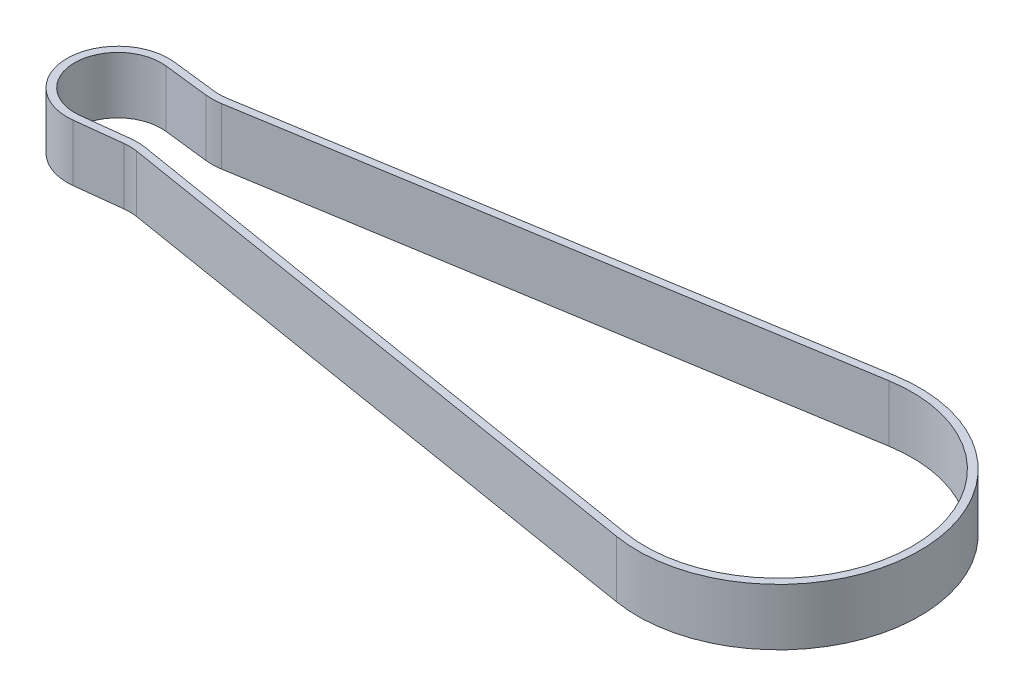
ISO-10303-21;
HEADER;
FILE_DESCRIPTION(('STEP AP214'),'2;1');
FILE_NAME('part.step','',(''),(''),'','','');
FILE_SCHEMA(('AUTOMOTIVE_DESIGN { 1 0 10303 214 1 1 1 1 }'));
ENDSEC;
DATA;
#1=APPLICATION_CONTEXT('core data for automotive mechanical design processes');
#2=APPLICATION_PROTOCOL_DEFINITION('international standard','automotive_design',2000,#1);
#3=PRODUCT_CONTEXT('',#1,'mechanical');
#4=PRODUCT('Part','Part','',(#3));
#5=PRODUCT_RELATED_PRODUCT_CATEGORY('part','',(#4));
#6=PRODUCT_DEFINITION_FORMATION('','',#4);
#7=PRODUCT_DEFINITION_CONTEXT('part definition',#1,'design');
#8=PRODUCT_DEFINITION('design','',#6,#7);
#9=PRODUCT_DEFINITION_SHAPE('','',#8);
#10=(LENGTH_UNIT() NAMED_UNIT(*) SI_UNIT(.MILLI.,.METRE.));
#11=(NAMED_UNIT(*) PLANE_ANGLE_UNIT() SI_UNIT($,.RADIAN.));
#12=(NAMED_UNIT(*) SI_UNIT($,.STERADIAN.) SOLID_ANGLE_UNIT());
#13=UNCERTAINTY_MEASURE_WITH_UNIT(LENGTH_MEASURE(1.E-05),#10,'distance_accuracy_value','');
#14=(GEOMETRIC_REPRESENTATION_CONTEXT(3) GLOBAL_UNCERTAINTY_ASSIGNED_CONTEXT((#13)) GLOBAL_UNIT_ASSIGNED_CONTEXT((#10,
#11,#12)) REPRESENTATION_CONTEXT('',''));
#15=CARTESIAN_POINT('',(0.,0.,0.));
#16=DIRECTION('',(0.,0.,1.));
#17=DIRECTION('',(1.,0.,0.));
#18=AXIS2_PLACEMENT_3D('',#15,#16,#17);
#19=CARTESIAN_POINT('',(0.,-3.,0.));
#20=DIRECTION('',(0.,1.,0.));
#21=DIRECTION('',(0.,0.,1.));
#22=AXIS2_PLACEMENT_3D('',#19,#20,#21);
#23=CYLINDRICAL_SURFACE('',#22,5.375);
#24=DIRECTION('',(0.,1.,0.));
#25=VECTOR('',#24,1.);
#26=CARTESIAN_POINT('',(0.617779055512067,-3.,5.33937955558233));
#27=LINE('',#26,#25);
#28=CARTESIAN_POINT('',(0.617779055512067,-3.,5.33937955558233));
#29=VERTEX_POINT('',#28);
#30=CARTESIAN_POINT('',(0.617779055512067,3.,5.33937955558233));
#31=VERTEX_POINT('',#30);
#32=EDGE_CURVE('E138',#29,#31,#27,.T.);
#33=ORIENTED_EDGE('',*,*,#32,.T.);
#34=CARTESIAN_POINT('',(0.,3.,0.));
#35=DIRECTION('',(0.,1.,0.));
#36=DIRECTION('',(1.,0.,0.));
#37=AXIS2_PLACEMENT_3D('',#34,#35,#36);
#38=CIRCLE('',#37,5.375);
#39=CARTESIAN_POINT('',(0.617779055512381,3.,-5.3393795555823));
#40=VERTEX_POINT('',#39);
#41=EDGE_CURVE('E291',#40,#31,#38,.T.);
#42=ORIENTED_EDGE('',*,*,#41,.F.);
#43=DIRECTION('',(0.,1.,0.));
#44=VECTOR('',#43,1.);
#45=CARTESIAN_POINT('',(0.617779055512381,-3.,-5.3393795555823));
#46=LINE('',#45,#44);
#47=CARTESIAN_POINT('',(0.617779055512381,-3.,-5.3393795555823));
#48=VERTEX_POINT('',#47);
#49=EDGE_CURVE('E12',#48,#40,#46,.T.);
#50=ORIENTED_EDGE('',*,*,#49,.F.);
#51=CARTESIAN_POINT('',(0.,-3.,0.));
#52=DIRECTION('',(0.,1.,0.));
#53=DIRECTION('',(1.,0.,0.));
#54=AXIS2_PLACEMENT_3D('',#51,#52,#53);
#55=CIRCLE('',#54,5.375);
#56=EDGE_CURVE('E334',#48,#29,#55,.T.);
#57=ORIENTED_EDGE('',*,*,#56,.T.);
#58=EDGE_LOOP('',(#33,#42,#50,#57));
#59=FACE_BOUND('',#58,.T.);
#60=ADVANCED_FACE('F135',(#59),#23,.T.);
#61=CARTESIAN_POINT('',(0.617779055512381,-3.,-5.3393795555823));
#62=DIRECTION('',(0.114935638234861,0.,-0.993372940573451));
#63=DIRECTION('',(-0.993372940573451,0.,-0.114935638234861));
#64=AXIS2_PLACEMENT_3D('',#61,#62,#63);
#65=PLANE('',#64);
#66=ORIENTED_EDGE('',*,*,#49,.T.);
#67=DIRECTION('',(-0.993372940573451,0.,-0.114935638234861));
#68=VECTOR('',#67,1.);
#69=CARTESIAN_POINT('',(0.617779055512381,3.,-5.3393795555823));
#70=LINE('',#69,#68);
#71=CARTESIAN_POINT('',(5.42532180882562,3.,-4.78313529713244));
#72=VERTEX_POINT('',#71);
#73=EDGE_CURVE('E312',#72,#40,#70,.T.);
#74=ORIENTED_EDGE('',*,*,#73,.F.);
#75=DIRECTION('',(0.,1.,0.));
#76=VECTOR('',#75,1.);
#77=CARTESIAN_POINT('',(5.42532180882562,-3.,-4.78313529713244));
#78=LINE('',#77,#76);
#79=CARTESIAN_POINT('',(5.42532180882562,-3.,-4.78313529713244));
#80=VERTEX_POINT('',#79);
#81=EDGE_CURVE('E143',#80,#72,#78,.T.);
#82=ORIENTED_EDGE('',*,*,#81,.F.);
#83=DIRECTION('',(-0.993372940573451,0.,-0.114935638234861));
#84=VECTOR('',#83,1.);
#85=CARTESIAN_POINT('',(0.617779055512381,-3.,-5.3393795555823));
#86=LINE('',#85,#84);
#87=EDGE_CURVE('E365',#80,#48,#86,.T.);
#88=ORIENTED_EDGE('',*,*,#87,.T.);
#89=EDGE_LOOP('',(#66,#74,#82,#88));
#90=FACE_BOUND('',#89,.T.);
#91=ADVANCED_FACE('F386',(#90),#65,.T.);
#92=CARTESIAN_POINT('',(5.99999999999994,-3.,-9.75000000000031));
#93=DIRECTION('',(0.,1.,0.));
#94=DIRECTION('',(0.,0.,1.));
#95=AXIS2_PLACEMENT_3D('',#92,#93,#94);
#96=CYLINDRICAL_SURFACE('',#95,5.00000000000061);
#97=ORIENTED_EDGE('',*,*,#81,.T.);
#98=CARTESIAN_POINT('',(5.99999999999994,3.,-9.75000000000031));
#99=DIRECTION('',(0.,1.,0.));
#100=DIRECTION('',(1.,0.,0.));
#101=AXIS2_PLACEMENT_3D('',#98,#99,#100);
#102=CIRCLE('',#101,5.00000000000061);
#103=CARTESIAN_POINT('',(6.80614708076724,3.,-4.81541522677203));
#104=VERTEX_POINT('',#103);
#105=EDGE_CURVE('E309',#104,#72,#102,.F.);
#106=ORIENTED_EDGE('',*,*,#105,.F.);
#107=DIRECTION('',(0.,1.,0.));
#108=VECTOR('',#107,1.);
#109=CARTESIAN_POINT('',(6.80614708076724,-3.,-4.81541522677203));
#110=LINE('',#109,#108);
#111=CARTESIAN_POINT('',(6.80614708076724,-3.,-4.81541522677203));
#112=VERTEX_POINT('',#111);
#113=EDGE_CURVE('E369',#112,#104,#110,.T.);
#114=ORIENTED_EDGE('',*,*,#113,.F.);
#115=CARTESIAN_POINT('',(5.99999999999994,-3.,-9.75000000000031));
#116=DIRECTION('',(0.,1.,0.));
#117=DIRECTION('',(1.,0.,0.));
#118=AXIS2_PLACEMENT_3D('',#115,#116,#117);
#119=CIRCLE('',#118,5.00000000000061);
#120=EDGE_CURVE('E362',#112,#80,#119,.F.);
#121=ORIENTED_EDGE('',*,*,#120,.T.);
#122=EDGE_LOOP('',(#97,#106,#114,#121));
#123=FACE_BOUND('',#122,.T.);
#124=ADVANCED_FACE('F407',(#123),#96,.F.);
#125=CARTESIAN_POINT('',(67.4936509639095,-3.,-14.7297355480846));
#126=DIRECTION('',(-0.161229416153464,0.,-0.986916954645533));
#127=DIRECTION('',(-0.986916954645533,0.,0.161229416153464));
#128=AXIS2_PLACEMENT_3D('',#125,#126,#127);
#129=PLANE('',#128);
#130=ORIENTED_EDGE('',*,*,#113,.T.);
#131=DIRECTION('',(-0.986916954645533,0.,0.161229416153464));
#132=VECTOR('',#131,1.);
#133=CARTESIAN_POINT('',(67.4936509639095,3.,-14.7297355480846));
#134=LINE('',#133,#132);
#135=CARTESIAN_POINT('',(67.4936509639095,3.,-14.7297355480846));
#136=VERTEX_POINT('',#135);
#137=EDGE_CURVE('E306',#136,#104,#134,.T.);
#138=ORIENTED_EDGE('',*,*,#137,.F.);
#139=DIRECTION('',(0.,1.,0.));
#140=VECTOR('',#139,1.);
#141=CARTESIAN_POINT('',(67.4936509639095,-3.,-14.7297355480846));
#142=LINE('',#141,#140);
#143=CARTESIAN_POINT('',(67.4936509639095,-3.,-14.7297355480846));
#144=VERTEX_POINT('',#143);
#145=EDGE_CURVE('E371',#144,#136,#142,.T.);
#146=ORIENTED_EDGE('',*,*,#145,.F.);
#147=DIRECTION('',(-0.986916954645533,0.,0.161229416153464));
#148=VECTOR('',#147,1.);
#149=CARTESIAN_POINT('',(67.4936509639095,-3.,-14.7297355480846));
#150=LINE('',#149,#148);
#151=EDGE_CURVE('E359',#144,#112,#150,.T.);
#152=ORIENTED_EDGE('',*,*,#151,.T.);
#153=EDGE_LOOP('',(#130,#138,#146,#152));
#154=FACE_BOUND('',#153,.T.);
#155=ADVANCED_FACE('F404',(#154),#129,.T.);
#156=CARTESIAN_POINT('',(69.9,-3.,0.));
#157=DIRECTION('',(0.,1.,0.));
#158=DIRECTION('',(0.,0.,1.));
#159=AXIS2_PLACEMENT_3D('',#156,#157,#158);
#160=CYLINDRICAL_SURFACE('',#159,14.925);
#161=ORIENTED_EDGE('',*,*,#145,.T.);
#162=CARTESIAN_POINT('',(69.9,3.,0.));
#163=DIRECTION('',(0.,1.,0.));
#164=DIRECTION('',(1.,0.,0.));
#165=AXIS2_PLACEMENT_3D('',#162,#163,#164);
#166=CIRCLE('',#165,14.925);
#167=CARTESIAN_POINT('',(67.4936509639096,3.,14.7297355480846));
#168=VERTEX_POINT('',#167);
#169=EDGE_CURVE('E303',#168,#136,#166,.T.);
#170=ORIENTED_EDGE('',*,*,#169,.F.);
#171=DIRECTION('',(0.,1.,0.));
#172=VECTOR('',#171,1.);
#173=CARTESIAN_POINT('',(67.4936509639096,-3.,14.7297355480846));
#174=LINE('',#173,#172);
#175=CARTESIAN_POINT('',(67.4936509639096,-3.,14.7297355480846));
#176=VERTEX_POINT('',#175);
#177=EDGE_CURVE('E373',#176,#168,#174,.T.);
#178=ORIENTED_EDGE('',*,*,#177,.F.);
#179=CARTESIAN_POINT('',(69.9,-3.,0.));
#180=DIRECTION('',(0.,1.,0.));
#181=DIRECTION('',(1.,0.,0.));
#182=AXIS2_PLACEMENT_3D('',#179,#180,#181);
#183=CIRCLE('',#182,14.925);
#184=EDGE_CURVE('E356',#176,#144,#183,.T.);
#185=ORIENTED_EDGE('',*,*,#184,.T.);
#186=EDGE_LOOP('',(#161,#170,#178,#185));
#187=FACE_BOUND('',#186,.T.);
#188=ADVANCED_FACE('F402',(#187),#160,.T.);
#189=CARTESIAN_POINT('',(67.4936509639096,-3.,14.7297355480846));
#190=DIRECTION('',(-0.161229416153464,0.,0.986916954645533));
#191=DIRECTION('',(0.986916954645533,0.,0.161229416153464));
#192=AXIS2_PLACEMENT_3D('',#189,#190,#191);
#193=PLANE('',#192);
#194=ORIENTED_EDGE('',*,*,#177,.T.);
#195=DIRECTION('',(0.986916954645533,0.,0.161229416153464));
#196=VECTOR('',#195,1.);
#197=CARTESIAN_POINT('',(67.4936509639096,3.,14.7297355480846));
#198=LINE('',#197,#196);
#199=CARTESIAN_POINT('',(6.80614708076727,3.,4.81541522677203));
#200=VERTEX_POINT('',#199);
#201=EDGE_CURVE('E300',#200,#168,#198,.T.);
#202=ORIENTED_EDGE('',*,*,#201,.F.);
#203=DIRECTION('',(0.,1.,0.));
#204=VECTOR('',#203,1.);
#205=CARTESIAN_POINT('',(6.80614708076727,-3.,4.81541522677203));
#206=LINE('',#205,#204);
#207=CARTESIAN_POINT('',(6.80614708076727,-3.,4.81541522677203));
#208=VERTEX_POINT('',#207);
#209=EDGE_CURVE('E375',#208,#200,#206,.T.);
#210=ORIENTED_EDGE('',*,*,#209,.F.);
#211=DIRECTION('',(0.986916954645533,0.,0.161229416153464));
#212=VECTOR('',#211,1.);
#213=CARTESIAN_POINT('',(67.4936509639096,-3.,14.7297355480846));
#214=LINE('',#213,#212);
#215=EDGE_CURVE('E353',#208,#176,#214,.T.);
#216=ORIENTED_EDGE('',*,*,#215,.T.);
#217=EDGE_LOOP('',(#194,#202,#210,#216));
#218=FACE_BOUND('',#217,.T.);
#219=ADVANCED_FACE('F400',(#218),#193,.T.);
#220=CARTESIAN_POINT('',(5.99999999999994,-3.,9.75000000000031));
#221=DIRECTION('',(0.,1.,0.));
#222=DIRECTION('',(0.,0.,1.));
#223=AXIS2_PLACEMENT_3D('',#220,#221,#222);
#224=CYLINDRICAL_SURFACE('',#223,5.00000000000061);
#225=ORIENTED_EDGE('',*,*,#209,.T.);
#226=CARTESIAN_POINT('',(5.99999999999994,3.,9.75000000000031));
#227=DIRECTION('',(0.,1.,0.));
#228=DIRECTION('',(1.,0.,0.));
#229=AXIS2_PLACEMENT_3D('',#226,#227,#228);
#230=CIRCLE('',#229,5.00000000000061);
#231=CARTESIAN_POINT('',(5.42532180882563,3.,4.78313529713244));
#232=VERTEX_POINT('',#231);
#233=EDGE_CURVE('E297',#232,#200,#230,.F.);
#234=ORIENTED_EDGE('',*,*,#233,.F.);
#235=DIRECTION('',(0.,1.,0.));
#236=VECTOR('',#235,1.);
#237=CARTESIAN_POINT('',(5.42532180882563,-3.,4.78313529713244));
#238=LINE('',#237,#236);
#239=CARTESIAN_POINT('',(5.42532180882563,-3.,4.78313529713244));
#240=VERTEX_POINT('',#239);
#241=EDGE_CURVE('E376',#240,#232,#238,.T.);
#242=ORIENTED_EDGE('',*,*,#241,.F.);
#243=CARTESIAN_POINT('',(5.99999999999994,-3.,9.75000000000031));
#244=DIRECTION('',(0.,1.,0.));
#245=DIRECTION('',(1.,0.,0.));
#246=AXIS2_PLACEMENT_3D('',#243,#244,#245);
#247=CIRCLE('',#246,5.00000000000061);
#248=EDGE_CURVE('E350',#240,#208,#247,.F.);
#249=ORIENTED_EDGE('',*,*,#248,.T.);
#250=EDGE_LOOP('',(#225,#234,#242,#249));
#251=FACE_BOUND('',#250,.T.);
#252=ADVANCED_FACE('F396',(#251),#224,.F.);
#253=CARTESIAN_POINT('',(0.617779055512067,-3.,5.33937955558233));
#254=DIRECTION('',(0.114935638234861,0.,0.993372940573451));
#255=DIRECTION('',(0.993372940573451,0.,-0.114935638234861));
#256=AXIS2_PLACEMENT_3D('',#253,#254,#255);
#257=PLANE('',#256);
#258=ORIENTED_EDGE('',*,*,#241,.T.);
#259=DIRECTION('',(0.993372940573451,0.,-0.114935638234861));
#260=VECTOR('',#259,1.);
#261=CARTESIAN_POINT('',(0.617779055512067,3.,5.33937955558233));
#262=LINE('',#261,#260);
#263=EDGE_CURVE('E294',#31,#232,#262,.T.);
#264=ORIENTED_EDGE('',*,*,#263,.F.);
#265=ORIENTED_EDGE('',*,*,#32,.F.);
#266=DIRECTION('',(0.993372940573451,0.,-0.114935638234861));
#267=VECTOR('',#266,1.);
#268=CARTESIAN_POINT('',(0.617779055512067,-3.,5.33937955558233));
#269=LINE('',#268,#267);
#270=EDGE_CURVE('E347',#29,#240,#269,.T.);
#271=ORIENTED_EDGE('',*,*,#270,.T.);
#272=EDGE_LOOP('',(#258,#264,#265,#271));
#273=FACE_BOUND('',#272,.T.);
#274=ADVANCED_FACE('F380',(#273),#257,.T.);
#275=CARTESIAN_POINT('',(0.,-3.,0.));
#276=DIRECTION('',(0.,1.,0.));
#277=DIRECTION('',(0.,0.,1.));
#278=AXIS2_PLACEMENT_3D('',#275,#276,#277);
#279=PLANE('',#278);
#280=DIRECTION('',(-0.993372940573451,0.,-0.114935638234861));
#281=VECTOR('',#280,1.);
#282=CARTESIAN_POINT('',(0.525830544924492,-3.,-4.54468120312354));
#283=LINE('',#282,#281);
#284=CARTESIAN_POINT('',(5.33337329823774,-3.,-3.98843694467368));
#285=VERTEX_POINT('',#284);
#286=CARTESIAN_POINT('',(0.525830544924492,-3.,-4.54468120312354));
#287=VERTEX_POINT('',#286);
#288=EDGE_CURVE('E260',#285,#287,#283,.T.);
#289=ORIENTED_EDGE('',*,*,#288,.T.);
#290=CARTESIAN_POINT('',(0.,-3.,0.));
#291=DIRECTION('',(0.,1.,0.));
#292=DIRECTION('',(1.,0.,0.));
#293=AXIS2_PLACEMENT_3D('',#290,#291,#292);
#294=CIRCLE('',#293,4.575);
#295=CARTESIAN_POINT('',(0.525830544924178,-3.,4.54468120312357));
#296=VERTEX_POINT('',#295);
#297=EDGE_CURVE('E315',#287,#296,#294,.T.);
#298=ORIENTED_EDGE('',*,*,#297,.T.);
#299=DIRECTION('',(0.993372940573451,0.,-0.114935638234861));
#300=VECTOR('',#299,1.);
#301=CARTESIAN_POINT('',(0.525830544924178,-3.,4.54468120312357));
#302=LINE('',#301,#300);
#303=CARTESIAN_POINT('',(5.33337329823774,-3.,3.98843694467367));
#304=VERTEX_POINT('',#303);
#305=EDGE_CURVE('E255',#296,#304,#302,.T.);
#306=ORIENTED_EDGE('',*,*,#305,.T.);
#307=CARTESIAN_POINT('',(5.99999999999994,-3.,9.75000000000031));
#308=DIRECTION('',(0.,1.,0.));
#309=DIRECTION('',(1.,0.,0.));
#310=AXIS2_PLACEMENT_3D('',#307,#308,#309);
#311=CIRCLE('',#310,5.80000000000061);
#312=CARTESIAN_POINT('',(6.93513061369002,-3.,4.0258816630556));
#313=VERTEX_POINT('',#312);
#314=EDGE_CURVE('E151',#304,#313,#311,.F.);
#315=ORIENTED_EDGE('',*,*,#314,.T.);
#316=DIRECTION('',(0.986916954645533,0.,0.161229416153464));
#317=VECTOR('',#316,1.);
#318=CARTESIAN_POINT('',(67.6226344968324,-3.,13.9402019843682));
#319=LINE('',#318,#317);
#320=CARTESIAN_POINT('',(67.6226344968324,-3.,13.9402019843682));
#321=VERTEX_POINT('',#320);
#322=EDGE_CURVE('E319',#313,#321,#319,.T.);
#323=ORIENTED_EDGE('',*,*,#322,.T.);
#324=CARTESIAN_POINT('',(69.9,-3.,0.));
#325=DIRECTION('',(0.,1.,0.));
#326=DIRECTION('',(1.,0.,0.));
#327=AXIS2_PLACEMENT_3D('',#324,#325,#326);
#328=CIRCLE('',#327,14.125);
#329=CARTESIAN_POINT('',(67.6226344968323,-3.,-13.9402019843681));
#330=VERTEX_POINT('',#329);
#331=EDGE_CURVE('E322',#321,#330,#328,.T.);
#332=ORIENTED_EDGE('',*,*,#331,.T.);
#333=DIRECTION('',(-0.986916954645533,0.,0.161229416153464));
#334=VECTOR('',#333,1.);
#335=CARTESIAN_POINT('',(67.6226344968323,-3.,-13.9402019843681));
#336=LINE('',#335,#334);
#337=CARTESIAN_POINT('',(6.93513061369001,-3.,-4.0258816630556));
#338=VERTEX_POINT('',#337);
#339=EDGE_CURVE('E325',#330,#338,#336,.T.);
#340=ORIENTED_EDGE('',*,*,#339,.T.);
#341=CARTESIAN_POINT('',(5.99999999999994,-3.,-9.75000000000031));
#342=DIRECTION('',(0.,1.,0.));
#343=DIRECTION('',(1.,0.,0.));
#344=AXIS2_PLACEMENT_3D('',#341,#342,#343);
#345=CIRCLE('',#344,5.80000000000061);
#346=EDGE_CURVE('E328',#338,#285,#345,.F.);
#347=ORIENTED_EDGE('',*,*,#346,.T.);
#348=EDGE_LOOP('',(#289,#298,#306,#315,#323,#332,#340,#347));
#349=FACE_BOUND('',#348,.T.);
#350=ORIENTED_EDGE('',*,*,#56,.F.);
#351=ORIENTED_EDGE('',*,*,#87,.F.);
#352=ORIENTED_EDGE('',*,*,#120,.F.);
#353=ORIENTED_EDGE('',*,*,#151,.F.);
#354=ORIENTED_EDGE('',*,*,#184,.F.);
#355=ORIENTED_EDGE('',*,*,#215,.F.);
#356=ORIENTED_EDGE('',*,*,#248,.F.);
#357=ORIENTED_EDGE('',*,*,#270,.F.);
#358=EDGE_LOOP('',(#350,#351,#352,#353,#354,#355,#356,#357));
#359=FACE_BOUND('',#358,.T.);
#360=ADVANCED_FACE('F390',(#349,#359),#279,.F.);
#361=CARTESIAN_POINT('',(0.,-3.,0.));
#362=DIRECTION('',(0.,1.,0.));
#363=DIRECTION('',(0.,0.,1.));
#364=AXIS2_PLACEMENT_3D('',#361,#362,#363);
#365=CYLINDRICAL_SURFACE('',#364,4.575);
#366=DIRECTION('',(0.,1.,0.));
#367=VECTOR('',#366,1.);
#368=CARTESIAN_POINT('',(0.525830544924492,-3.,-4.54468120312354));
#369=LINE('',#368,#367);
#370=CARTESIAN_POINT('',(0.525830544924492,3.,-4.54468120312354));
#371=VERTEX_POINT('',#370);
#372=EDGE_CURVE('E265',#287,#371,#369,.T.);
#373=ORIENTED_EDGE('',*,*,#372,.T.);
#374=CARTESIAN_POINT('',(0.,3.,0.));
#375=DIRECTION('',(0.,1.,0.));
#376=DIRECTION('',(1.,0.,0.));
#377=AXIS2_PLACEMENT_3D('',#374,#375,#376);
#378=CIRCLE('',#377,4.575);
#379=CARTESIAN_POINT('',(0.525830544924178,3.,4.54468120312357));
#380=VERTEX_POINT('',#379);
#381=EDGE_CURVE('E263',#371,#380,#378,.T.);
#382=ORIENTED_EDGE('',*,*,#381,.T.);
#383=DIRECTION('',(0.,1.,0.));
#384=VECTOR('',#383,1.);
#385=CARTESIAN_POINT('',(0.525830544924178,-3.,4.54468120312357));
#386=LINE('',#385,#384);
#387=EDGE_CURVE('E248',#296,#380,#386,.T.);
#388=ORIENTED_EDGE('',*,*,#387,.F.);
#389=ORIENTED_EDGE('',*,*,#297,.F.);
#390=EDGE_LOOP('',(#373,#382,#388,#389));
#391=FACE_BOUND('',#390,.T.);
#392=ADVANCED_FACE('F264',(#391),#365,.F.);
#393=CARTESIAN_POINT('',(0.525830544924492,-3.,-4.54468120312354));
#394=DIRECTION('',(0.114935638234861,0.,-0.993372940573451));
#395=DIRECTION('',(-0.993372940573451,0.,-0.114935638234861));
#396=AXIS2_PLACEMENT_3D('',#393,#394,#395);
#397=PLANE('',#396);
#398=DIRECTION('',(0.,1.,0.));
#399=VECTOR('',#398,1.);
#400=CARTESIAN_POINT('',(5.33337329823774,-3.,-3.98843694467368));
#401=LINE('',#400,#399);
#402=CARTESIAN_POINT('',(5.33337329823774,3.,-3.98843694467367));
#403=VERTEX_POINT('',#402);
#404=EDGE_CURVE('E335',#285,#403,#401,.T.);
#405=ORIENTED_EDGE('',*,*,#404,.T.);
#406=DIRECTION('',(-0.993372940573451,0.,-0.114935638234861));
#407=VECTOR('',#406,1.);
#408=CARTESIAN_POINT('',(0.525830544924492,3.,-4.54468120312354));
#409=LINE('',#408,#407);
#410=EDGE_CURVE('E289',#403,#371,#409,.T.);
#411=ORIENTED_EDGE('',*,*,#410,.T.);
#412=ORIENTED_EDGE('',*,*,#372,.F.);
#413=ORIENTED_EDGE('',*,*,#288,.F.);
#414=EDGE_LOOP('',(#405,#411,#412,#413));
#415=FACE_BOUND('',#414,.T.);
#416=ADVANCED_FACE('F490',(#415),#397,.F.);
#417=CARTESIAN_POINT('',(5.99999999999994,-3.,-9.75000000000031));
#418=DIRECTION('',(0.,1.,0.));
#419=DIRECTION('',(0.,0.,1.));
#420=AXIS2_PLACEMENT_3D('',#417,#418,#419);
#421=CYLINDRICAL_SURFACE('',#420,5.80000000000061);
#422=DIRECTION('',(0.,1.,0.));
#423=VECTOR('',#422,1.);
#424=CARTESIAN_POINT('',(6.93513061369001,-3.,-4.0258816630556));
#425=LINE('',#424,#423);
#426=CARTESIAN_POINT('',(6.93513061369001,3.,-4.0258816630556));
#427=VERTEX_POINT('',#426);
#428=EDGE_CURVE('E337',#338,#427,#425,.T.);
#429=ORIENTED_EDGE('',*,*,#428,.T.);
#430=CARTESIAN_POINT('',(5.99999999999994,3.,-9.75000000000031));
#431=DIRECTION('',(0.,1.,0.));
#432=DIRECTION('',(1.,0.,0.));
#433=AXIS2_PLACEMENT_3D('',#430,#431,#432);
#434=CIRCLE('',#433,5.80000000000061);
#435=EDGE_CURVE('E286',#427,#403,#434,.F.);
#436=ORIENTED_EDGE('',*,*,#435,.T.);
#437=ORIENTED_EDGE('',*,*,#404,.F.);
#438=ORIENTED_EDGE('',*,*,#346,.F.);
#439=EDGE_LOOP('',(#429,#436,#437,#438));
#440=FACE_BOUND('',#439,.T.);
#441=ADVANCED_FACE('F500',(#440),#421,.T.);
#442=CARTESIAN_POINT('',(67.6226344968323,-3.,-13.9402019843681));
#443=DIRECTION('',(-0.161229416153464,0.,-0.986916954645533));
#444=DIRECTION('',(-0.986916954645533,0.,0.161229416153464));
#445=AXIS2_PLACEMENT_3D('',#442,#443,#444);
#446=PLANE('',#445);
#447=DIRECTION('',(0.,1.,0.));
#448=VECTOR('',#447,1.);
#449=CARTESIAN_POINT('',(67.6226344968323,-3.,-13.9402019843681));
#450=LINE('',#449,#448);
#451=CARTESIAN_POINT('',(67.6226344968323,3.,-13.9402019843681));
#452=VERTEX_POINT('',#451);
#453=EDGE_CURVE('E339',#330,#452,#450,.T.);
#454=ORIENTED_EDGE('',*,*,#453,.T.);
#455=DIRECTION('',(-0.986916954645533,0.,0.161229416153464));
#456=VECTOR('',#455,1.);
#457=CARTESIAN_POINT('',(67.6226344968323,3.,-13.9402019843681));
#458=LINE('',#457,#456);
#459=EDGE_CURVE('E283',#452,#427,#458,.T.);
#460=ORIENTED_EDGE('',*,*,#459,.T.);
#461=ORIENTED_EDGE('',*,*,#428,.F.);
#462=ORIENTED_EDGE('',*,*,#339,.F.);
#463=EDGE_LOOP('',(#454,#460,#461,#462));
#464=FACE_BOUND('',#463,.T.);
#465=ADVANCED_FACE('F511',(#464),#446,.F.);
#466=CARTESIAN_POINT('',(69.9,-3.,0.));
#467=DIRECTION('',(0.,1.,0.));
#468=DIRECTION('',(0.,0.,1.));
#469=AXIS2_PLACEMENT_3D('',#466,#467,#468);
#470=CYLINDRICAL_SURFACE('',#469,14.125);
#471=DIRECTION('',(0.,1.,0.));
#472=VECTOR('',#471,1.);
#473=CARTESIAN_POINT('',(67.6226344968324,-3.,13.9402019843682));
#474=LINE('',#473,#472);
#475=CARTESIAN_POINT('',(67.6226344968324,3.,13.9402019843682));
#476=VERTEX_POINT('',#475);
#477=EDGE_CURVE('E341',#321,#476,#474,.T.);
#478=ORIENTED_EDGE('',*,*,#477,.T.);
#479=CARTESIAN_POINT('',(69.9,3.,0.));
#480=DIRECTION('',(0.,1.,0.));
#481=DIRECTION('',(1.,0.,0.));
#482=AXIS2_PLACEMENT_3D('',#479,#480,#481);
#483=CIRCLE('',#482,14.125);
#484=EDGE_CURVE('E280',#476,#452,#483,.T.);
#485=ORIENTED_EDGE('',*,*,#484,.T.);
#486=ORIENTED_EDGE('',*,*,#453,.F.);
#487=ORIENTED_EDGE('',*,*,#331,.F.);
#488=EDGE_LOOP('',(#478,#485,#486,#487));
#489=FACE_BOUND('',#488,.T.);
#490=ADVANCED_FACE('F522',(#489),#470,.F.);
#491=CARTESIAN_POINT('',(67.6226344968324,-3.,13.9402019843682));
#492=DIRECTION('',(-0.161229416153464,0.,0.986916954645533));
#493=DIRECTION('',(0.986916954645533,0.,0.161229416153464));
#494=AXIS2_PLACEMENT_3D('',#491,#492,#493);
#495=PLANE('',#494);
#496=DIRECTION('',(0.,1.,0.));
#497=VECTOR('',#496,1.);
#498=CARTESIAN_POINT('',(6.93513061369002,-3.,4.0258816630556));
#499=LINE('',#498,#497);
#500=CARTESIAN_POINT('',(6.93513061369002,3.,4.0258816630556));
#501=VERTEX_POINT('',#500);
#502=EDGE_CURVE('E343',#313,#501,#499,.T.);
#503=ORIENTED_EDGE('',*,*,#502,.T.);
#504=DIRECTION('',(0.986916954645533,0.,0.161229416153464));
#505=VECTOR('',#504,1.);
#506=CARTESIAN_POINT('',(67.6226344968324,3.,13.9402019843682));
#507=LINE('',#506,#505);
#508=EDGE_CURVE('E275',#501,#476,#507,.T.);
#509=ORIENTED_EDGE('',*,*,#508,.T.);
#510=ORIENTED_EDGE('',*,*,#477,.F.);
#511=ORIENTED_EDGE('',*,*,#322,.F.);
#512=EDGE_LOOP('',(#503,#509,#510,#511));
#513=FACE_BOUND('',#512,.T.);
#514=ADVANCED_FACE('F533',(#513),#495,.F.);
#515=CARTESIAN_POINT('',(5.99999999999994,-3.,9.75000000000031));
#516=DIRECTION('',(0.,1.,0.));
#517=DIRECTION('',(0.,0.,1.));
#518=AXIS2_PLACEMENT_3D('',#515,#516,#517);
#519=CYLINDRICAL_SURFACE('',#518,5.80000000000061);
#520=DIRECTION('',(0.,1.,0.));
#521=VECTOR('',#520,1.);
#522=CARTESIAN_POINT('',(5.33337329823774,-3.,3.98843694467367));
#523=LINE('',#522,#521);
#524=CARTESIAN_POINT('',(5.33337329823774,3.,3.98843694467367));
#525=VERTEX_POINT('',#524);
#526=EDGE_CURVE('E259',#304,#525,#523,.T.);
#527=ORIENTED_EDGE('',*,*,#526,.T.);
#528=CARTESIAN_POINT('',(5.99999999999994,3.,9.75000000000031));
#529=DIRECTION('',(0.,1.,0.));
#530=DIRECTION('',(1.,0.,0.));
#531=AXIS2_PLACEMENT_3D('',#528,#529,#530);
#532=CIRCLE('',#531,5.80000000000061);
#533=EDGE_CURVE('E273',#525,#501,#532,.F.);
#534=ORIENTED_EDGE('',*,*,#533,.T.);
#535=ORIENTED_EDGE('',*,*,#502,.F.);
#536=ORIENTED_EDGE('',*,*,#314,.F.);
#537=EDGE_LOOP('',(#527,#534,#535,#536));
#538=FACE_BOUND('',#537,.T.);
#539=ADVANCED_FACE('F544',(#538),#519,.T.);
#540=CARTESIAN_POINT('',(0.525830544924178,-3.,4.54468120312357));
#541=DIRECTION('',(0.114935638234861,0.,0.993372940573451));
#542=DIRECTION('',(0.993372940573451,0.,-0.114935638234861));
#543=AXIS2_PLACEMENT_3D('',#540,#541,#542);
#544=PLANE('',#543);
#545=ORIENTED_EDGE('',*,*,#387,.T.);
#546=DIRECTION('',(0.993372940573451,0.,-0.114935638234861));
#547=VECTOR('',#546,1.);
#548=CARTESIAN_POINT('',(0.525830544924178,3.,4.54468120312357));
#549=LINE('',#548,#547);
#550=EDGE_CURVE('E252',#380,#525,#549,.T.);
#551=ORIENTED_EDGE('',*,*,#550,.T.);
#552=ORIENTED_EDGE('',*,*,#526,.F.);
#553=ORIENTED_EDGE('',*,*,#305,.F.);
#554=EDGE_LOOP('',(#545,#551,#552,#553));
#555=FACE_BOUND('',#554,.T.);
#556=ADVANCED_FACE('F250',(#555),#544,.F.);
#557=CARTESIAN_POINT('',(0.,3.,0.));
#558=DIRECTION('',(0.,1.,0.));
#559=DIRECTION('',(0.,0.,1.));
#560=AXIS2_PLACEMENT_3D('',#557,#558,#559);
#561=PLANE('',#560);
#562=ORIENTED_EDGE('',*,*,#41,.T.);
#563=ORIENTED_EDGE('',*,*,#263,.T.);
#564=ORIENTED_EDGE('',*,*,#233,.T.);
#565=ORIENTED_EDGE('',*,*,#201,.T.);
#566=ORIENTED_EDGE('',*,*,#169,.T.);
#567=ORIENTED_EDGE('',*,*,#137,.T.);
#568=ORIENTED_EDGE('',*,*,#105,.T.);
#569=ORIENTED_EDGE('',*,*,#73,.T.);
#570=EDGE_LOOP('',(#562,#563,#564,#565,#566,#567,#568,#569));
#571=FACE_BOUND('',#570,.T.);
#572=ORIENTED_EDGE('',*,*,#550,.F.);
#573=ORIENTED_EDGE('',*,*,#381,.F.);
#574=ORIENTED_EDGE('',*,*,#410,.F.);
#575=ORIENTED_EDGE('',*,*,#435,.F.);
#576=ORIENTED_EDGE('',*,*,#459,.F.);
#577=ORIENTED_EDGE('',*,*,#484,.F.);
#578=ORIENTED_EDGE('',*,*,#508,.F.);
#579=ORIENTED_EDGE('',*,*,#533,.F.);
#580=EDGE_LOOP('',(#572,#573,#574,#575,#576,#577,#578,#579));
#581=FACE_BOUND('',#580,.T.);
#582=ADVANCED_FACE('F270',(#571,#581),#561,.T.);
#583=CLOSED_SHELL('',(#60,#91,#124,#155,#188,#219,#252,#274,#360,#392,#416,#441,#465,#490,#514,
#539,#556,#582));
#584=MANIFOLD_SOLID_BREP('B2',#583);
#585=ADVANCED_BREP_SHAPE_REPRESENTATION('',(#18,#584),#14);
#586=SHAPE_DEFINITION_REPRESENTATION(#9,#585);
ENDSEC;
END-ISO-10303-21;
